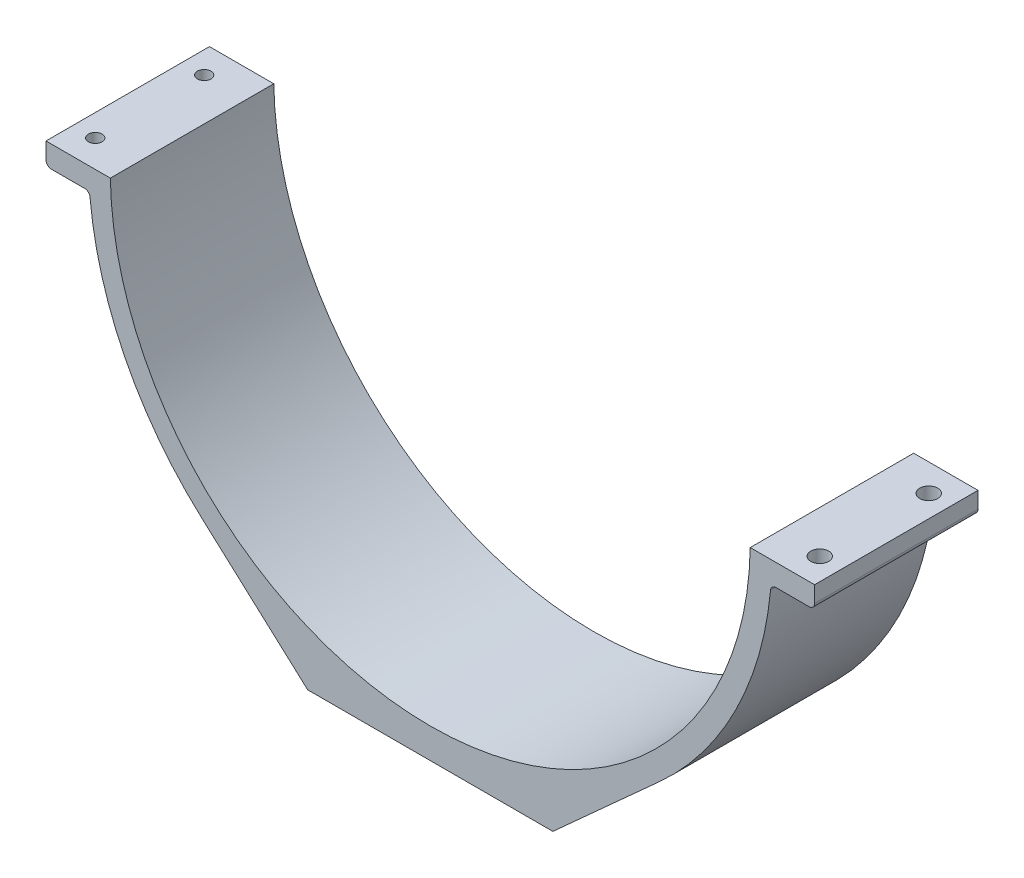
ISO-10303-21;
HEADER;
FILE_DESCRIPTION(('STEP AP214'),'2;1');
FILE_NAME('part.step','',(''),(''),'','','');
FILE_SCHEMA(('AUTOMOTIVE_DESIGN { 1 0 10303 214 1 1 1 1 }'));
ENDSEC;
DATA;
#1=APPLICATION_CONTEXT('core data for automotive mechanical design processes');
#2=APPLICATION_PROTOCOL_DEFINITION('international standard','automotive_design',2000,#1);
#3=PRODUCT_CONTEXT('',#1,'mechanical');
#4=PRODUCT('Part','Part','',(#3));
#5=PRODUCT_RELATED_PRODUCT_CATEGORY('part','',(#4));
#6=PRODUCT_DEFINITION_FORMATION('','',#4);
#7=PRODUCT_DEFINITION_CONTEXT('part definition',#1,'design');
#8=PRODUCT_DEFINITION('design','',#6,#7);
#9=PRODUCT_DEFINITION_SHAPE('','',#8);
#10=(LENGTH_UNIT() NAMED_UNIT(*) SI_UNIT(.MILLI.,.METRE.));
#11=(NAMED_UNIT(*) PLANE_ANGLE_UNIT() SI_UNIT($,.RADIAN.));
#12=(NAMED_UNIT(*) SI_UNIT($,.STERADIAN.) SOLID_ANGLE_UNIT());
#13=UNCERTAINTY_MEASURE_WITH_UNIT(LENGTH_MEASURE(1.E-05),#10,'distance_accuracy_value','');
#14=(GEOMETRIC_REPRESENTATION_CONTEXT(3) GLOBAL_UNCERTAINTY_ASSIGNED_CONTEXT((#13)) GLOBAL_UNIT_ASSIGNED_CONTEXT((#10,
#11,#12)) REPRESENTATION_CONTEXT('',''));
#15=CARTESIAN_POINT('',(0.,0.,0.));
#16=DIRECTION('',(0.,0.,1.));
#17=DIRECTION('',(1.,0.,0.));
#18=AXIS2_PLACEMENT_3D('',#15,#16,#17);
#19=CARTESIAN_POINT('',(-70.5404477118608,-1.,30.));
#20=DIRECTION('',(1.,0.,0.));
#21=DIRECTION('',(0.,1.,0.));
#22=AXIS2_PLACEMENT_3D('',#19,#20,#21);
#23=PLANE('',#22);
#24=DIRECTION('',(0.,-1.,0.));
#25=VECTOR('',#24,1.);
#26=CARTESIAN_POINT('',(-70.5404477118608,-1.,0.));
#27=LINE('',#26,#25);
#28=CARTESIAN_POINT('',(-70.5404477118608,-1.,0.));
#29=VERTEX_POINT('',#28);
#30=CARTESIAN_POINT('',(-70.5404477118608,-4.,0.));
#31=VERTEX_POINT('',#30);
#32=EDGE_CURVE('E200',#29,#31,#27,.T.);
#33=ORIENTED_EDGE('',*,*,#32,.T.);
#34=DIRECTION('',(0.,0.,-1.));
#35=VECTOR('',#34,1.);
#36=CARTESIAN_POINT('',(-70.5404477118608,-4.,30.));
#37=LINE('',#36,#35);
#38=CARTESIAN_POINT('',(-70.5404477118608,-4.,30.));
#39=VERTEX_POINT('',#38);
#40=EDGE_CURVE('E11',#39,#31,#37,.T.);
#41=ORIENTED_EDGE('',*,*,#40,.F.);
#42=DIRECTION('',(0.,-1.,0.));
#43=VECTOR('',#42,1.);
#44=CARTESIAN_POINT('',(-70.5404477118608,-1.,30.));
#45=LINE('',#44,#43);
#46=CARTESIAN_POINT('',(-70.5404477118608,-1.,30.));
#47=VERTEX_POINT('',#46);
#48=EDGE_CURVE('E246',#47,#39,#45,.T.);
#49=ORIENTED_EDGE('',*,*,#48,.F.);
#50=DIRECTION('',(0.,0.,-1.));
#51=VECTOR('',#50,1.);
#52=CARTESIAN_POINT('',(-70.5404477118608,-1.,30.));
#53=LINE('',#52,#51);
#54=EDGE_CURVE('E196',#47,#29,#53,.T.);
#55=ORIENTED_EDGE('',*,*,#54,.T.);
#56=EDGE_LOOP('',(#33,#41,#49,#55));
#57=FACE_BOUND('',#56,.T.);
#58=ADVANCED_FACE('F45',(#57),#23,.F.);
#59=CARTESIAN_POINT('',(-69.5404477118608,-4.,30.));
#60=DIRECTION('',(0.,0.,-1.));
#61=DIRECTION('',(-1.,0.,0.));
#62=AXIS2_PLACEMENT_3D('',#59,#60,#61);
#63=CYLINDRICAL_SURFACE('',#62,0.999999999999994);
#64=CARTESIAN_POINT('',(-69.5404477118608,-4.,0.));
#65=DIRECTION('',(0.,0.,1.));
#66=DIRECTION('',(1.,0.,0.));
#67=AXIS2_PLACEMENT_3D('',#64,#65,#66);
#68=CIRCLE('',#67,0.999999999999994);
#69=CARTESIAN_POINT('',(-69.5404477118608,-5.,0.));
#70=VERTEX_POINT('',#69);
#71=EDGE_CURVE('E204',#31,#70,#68,.T.);
#72=ORIENTED_EDGE('',*,*,#71,.T.);
#73=DIRECTION('',(0.,0.,-1.));
#74=VECTOR('',#73,1.);
#75=CARTESIAN_POINT('',(-69.5404477118608,-5.,30.));
#76=LINE('',#75,#74);
#77=CARTESIAN_POINT('',(-69.5404477118608,-5.,30.));
#78=VERTEX_POINT('',#77);
#79=EDGE_CURVE('E54',#78,#70,#76,.T.);
#80=ORIENTED_EDGE('',*,*,#79,.F.);
#81=CARTESIAN_POINT('',(-69.5404477118608,-4.,30.));
#82=DIRECTION('',(0.,0.,1.));
#83=DIRECTION('',(1.,0.,0.));
#84=AXIS2_PLACEMENT_3D('',#81,#82,#83);
#85=CIRCLE('',#84,0.999999999999994);
#86=EDGE_CURVE('E130',#39,#78,#85,.T.);
#87=ORIENTED_EDGE('',*,*,#86,.F.);
#88=ORIENTED_EDGE('',*,*,#40,.T.);
#89=EDGE_LOOP('',(#72,#80,#87,#88));
#90=FACE_BOUND('',#89,.T.);
#91=ADVANCED_FACE('F440',(#90),#63,.T.);
#92=CARTESIAN_POINT('',(-69.5404477118608,-5.,30.));
#93=DIRECTION('',(0.,1.,0.));
#94=DIRECTION('',(-1.,0.,0.));
#95=AXIS2_PLACEMENT_3D('',#92,#93,#94);
#96=PLANE('',#95);
#97=CARTESIAN_POINT('',(-66.4987110559215,-4.99999999999999,5.));
#98=DIRECTION('',(0.,-1.,0.));
#99=DIRECTION('',(0.,0.,-1.));
#100=AXIS2_PLACEMENT_3D('',#97,#98,#99);
#101=CIRCLE('',#100,1.24999999999999);
#102=CARTESIAN_POINT('',(-66.4987110559215,-4.99999999999999,3.75000000000001));
#103=VERTEX_POINT('',#102);
#104=EDGE_CURVE('E419',#103,#103,#101,.T.);
#105=ORIENTED_EDGE('',*,*,#104,.F.);
#106=EDGE_LOOP('',(#105));
#107=FACE_BOUND('',#106,.T.);
#108=CARTESIAN_POINT('',(-66.4987110559215,-4.99999999999999,25.));
#109=DIRECTION('',(0.,-1.,0.));
#110=DIRECTION('',(0.,0.,-1.));
#111=AXIS2_PLACEMENT_3D('',#108,#109,#110);
#112=CIRCLE('',#111,1.24999999999999);
#113=CARTESIAN_POINT('',(-66.4987110559215,-4.99999999999999,23.75));
#114=VERTEX_POINT('',#113);
#115=EDGE_CURVE('E427',#114,#114,#112,.T.);
#116=ORIENTED_EDGE('',*,*,#115,.F.);
#117=EDGE_LOOP('',(#116));
#118=FACE_BOUND('',#117,.T.);
#119=DIRECTION('',(1.,0.,0.));
#120=VECTOR('',#119,1.);
#121=CARTESIAN_POINT('',(-69.5404477118608,-5.,0.));
#122=LINE('',#121,#120);
#123=CARTESIAN_POINT('',(-63.4569743999822,-4.99999999999999,0.));
#124=VERTEX_POINT('',#123);
#125=EDGE_CURVE('E208',#70,#124,#122,.T.);
#126=ORIENTED_EDGE('',*,*,#125,.T.);
#127=DIRECTION('',(0.,0.,-1.));
#128=VECTOR('',#127,1.);
#129=CARTESIAN_POINT('',(-63.4569743999822,-4.99999999999999,30.));
#130=LINE('',#129,#128);
#131=CARTESIAN_POINT('',(-63.4569743999822,-4.99999999999999,30.));
#132=VERTEX_POINT('',#131);
#133=EDGE_CURVE('E288',#132,#124,#130,.T.);
#134=ORIENTED_EDGE('',*,*,#133,.F.);
#135=DIRECTION('',(1.,0.,0.));
#136=VECTOR('',#135,1.);
#137=CARTESIAN_POINT('',(-69.5404477118608,-5.,30.));
#138=LINE('',#137,#136);
#139=EDGE_CURVE('E299',#78,#132,#138,.T.);
#140=ORIENTED_EDGE('',*,*,#139,.F.);
#141=ORIENTED_EDGE('',*,*,#79,.T.);
#142=EDGE_LOOP('',(#126,#134,#140,#141));
#143=FACE_BOUND('',#142,.T.);
#144=ADVANCED_FACE('F297',(#107,#118,#143),#96,.F.);
#145=CARTESIAN_POINT('',(-63.4569743999822,-6.,30.));
#146=DIRECTION('',(0.,0.,-1.));
#147=DIRECTION('',(-1.,0.,0.));
#148=AXIS2_PLACEMENT_3D('',#145,#146,#147);
#149=CYLINDRICAL_SURFACE('',#148,1.00000000000001);
#150=CARTESIAN_POINT('',(-63.4569743999822,-6.,0.));
#151=DIRECTION('',(0.,0.,-1.));
#152=DIRECTION('',(1.,0.,0.));
#153=AXIS2_PLACEMENT_3D('',#150,#151,#152);
#154=CIRCLE('',#153,1.00000000000001);
#155=CARTESIAN_POINT('',(-62.4614147137572,-5.90586758707246,0.));
#156=VERTEX_POINT('',#155);
#157=EDGE_CURVE('E211',#124,#156,#154,.T.);
#158=ORIENTED_EDGE('',*,*,#157,.T.);
#159=DIRECTION('',(0.,0.,-1.));
#160=VECTOR('',#159,1.);
#161=CARTESIAN_POINT('',(-62.4614147137572,-5.90586758707246,30.));
#162=LINE('',#161,#160);
#163=CARTESIAN_POINT('',(-62.4614147137572,-5.90586758707246,30.));
#164=VERTEX_POINT('',#163);
#165=EDGE_CURVE('E284',#164,#156,#162,.T.);
#166=ORIENTED_EDGE('',*,*,#165,.F.);
#167=CARTESIAN_POINT('',(-63.4569743999822,-6.,30.));
#168=DIRECTION('',(0.,0.,-1.));
#169=DIRECTION('',(1.,0.,0.));
#170=AXIS2_PLACEMENT_3D('',#167,#168,#169);
#171=CIRCLE('',#170,1.00000000000001);
#172=EDGE_CURVE('E318',#132,#164,#171,.T.);
#173=ORIENTED_EDGE('',*,*,#172,.F.);
#174=ORIENTED_EDGE('',*,*,#133,.T.);
#175=EDGE_LOOP('',(#158,#166,#173,#174));
#176=FACE_BOUND('',#175,.T.);
#177=ADVANCED_FACE('F308',(#176),#149,.F.);
#178=CARTESIAN_POINT('',(0.,0.,30.));
#179=DIRECTION('',(0.,0.,-1.));
#180=DIRECTION('',(-1.,0.,0.));
#181=AXIS2_PLACEMENT_3D('',#178,#179,#180);
#182=CYLINDRICAL_SURFACE('',#181,62.74);
#183=CARTESIAN_POINT('',(0.,0.,0.));
#184=DIRECTION('',(0.,0.,1.));
#185=DIRECTION('',(1.,0.,0.));
#186=AXIS2_PLACEMENT_3D('',#183,#184,#185);
#187=CIRCLE('',#186,62.74);
#188=CARTESIAN_POINT('',(-42.0786666547349,-46.5370112121491,0.));
#189=VERTEX_POINT('',#188);
#190=EDGE_CURVE('E214',#156,#189,#187,.T.);
#191=ORIENTED_EDGE('',*,*,#190,.T.);
#192=DIRECTION('',(0.,0.,-1.));
#193=VECTOR('',#192,1.);
#194=CARTESIAN_POINT('',(-42.0786666547349,-46.5370112121491,30.));
#195=LINE('',#194,#193);
#196=CARTESIAN_POINT('',(-42.0786666547349,-46.5370112121491,30.));
#197=VERTEX_POINT('',#196);
#198=EDGE_CURVE('E280',#197,#189,#195,.T.);
#199=ORIENTED_EDGE('',*,*,#198,.F.);
#200=CARTESIAN_POINT('',(0.,0.,30.));
#201=DIRECTION('',(0.,0.,1.));
#202=DIRECTION('',(1.,0.,0.));
#203=AXIS2_PLACEMENT_3D('',#200,#201,#202);
#204=CIRCLE('',#203,62.74);
#205=EDGE_CURVE('E314',#164,#197,#204,.T.);
#206=ORIENTED_EDGE('',*,*,#205,.F.);
#207=ORIENTED_EDGE('',*,*,#165,.T.);
#208=EDGE_LOOP('',(#191,#199,#206,#207));
#209=FACE_BOUND('',#208,.T.);
#210=ADVANCED_FACE('F312',(#209),#182,.T.);
#211=CARTESIAN_POINT('',(-22.5,-64.24,30.));
#212=DIRECTION('',(0.670683242823318,0.741743882884112,0.));
#213=DIRECTION('',(-0.741743882884112,0.670683242823318,0.));
#214=AXIS2_PLACEMENT_3D('',#211,#212,#213);
#215=PLANE('',#214);
#216=DIRECTION('',(0.741743882884112,-0.670683242823318,0.));
#217=VECTOR('',#216,1.);
#218=CARTESIAN_POINT('',(-22.5,-64.24,0.));
#219=LINE('',#218,#217);
#220=CARTESIAN_POINT('',(-22.5,-64.24,0.));
#221=VERTEX_POINT('',#220);
#222=EDGE_CURVE('E217',#189,#221,#219,.T.);
#223=ORIENTED_EDGE('',*,*,#222,.T.);
#224=DIRECTION('',(0.,0.,-1.));
#225=VECTOR('',#224,1.);
#226=CARTESIAN_POINT('',(-22.5,-64.24,30.));
#227=LINE('',#226,#225);
#228=CARTESIAN_POINT('',(-22.5,-64.24,30.));
#229=VERTEX_POINT('',#228);
#230=EDGE_CURVE('E276',#229,#221,#227,.T.);
#231=ORIENTED_EDGE('',*,*,#230,.F.);
#232=DIRECTION('',(0.741743882884112,-0.670683242823318,0.));
#233=VECTOR('',#232,1.);
#234=CARTESIAN_POINT('',(-22.5,-64.24,30.));
#235=LINE('',#234,#233);
#236=EDGE_CURVE('E317',#197,#229,#235,.T.);
#237=ORIENTED_EDGE('',*,*,#236,.F.);
#238=ORIENTED_EDGE('',*,*,#198,.T.);
#239=EDGE_LOOP('',(#223,#231,#237,#238));
#240=FACE_BOUND('',#239,.T.);
#241=ADVANCED_FACE('F453',(#240),#215,.F.);
#242=CARTESIAN_POINT('',(-22.5,-64.24,30.));
#243=DIRECTION('',(0.,1.,0.));
#244=DIRECTION('',(0.,0.,1.));
#245=AXIS2_PLACEMENT_3D('',#242,#243,#244);
#246=PLANE('',#245);
#247=CARTESIAN_POINT('',(-20.,-64.24,5.));
#248=DIRECTION('',(0.,-1.,0.));
#249=DIRECTION('',(0.,0.,-1.));
#250=AXIS2_PLACEMENT_3D('',#247,#248,#249);
#251=CIRCLE('',#250,1.65);
#252=CARTESIAN_POINT('',(-20.,-64.24,3.35));
#253=VERTEX_POINT('',#252);
#254=EDGE_CURVE('E365',#253,#253,#251,.T.);
#255=ORIENTED_EDGE('',*,*,#254,.F.);
#256=EDGE_LOOP('',(#255));
#257=FACE_BOUND('',#256,.T.);
#258=CARTESIAN_POINT('',(20.,-64.24,5.));
#259=DIRECTION('',(0.,-1.,0.));
#260=DIRECTION('',(0.,0.,-1.));
#261=AXIS2_PLACEMENT_3D('',#258,#259,#260);
#262=CIRCLE('',#261,1.65);
#263=CARTESIAN_POINT('',(20.,-64.24,3.35));
#264=VERTEX_POINT('',#263);
#265=EDGE_CURVE('E364',#264,#264,#262,.T.);
#266=ORIENTED_EDGE('',*,*,#265,.F.);
#267=EDGE_LOOP('',(#266));
#268=FACE_BOUND('',#267,.T.);
#269=CARTESIAN_POINT('',(-20.0000000000051,-64.24,25.));
#270=DIRECTION('',(0.,-1.,0.));
#271=DIRECTION('',(0.,0.,-1.));
#272=AXIS2_PLACEMENT_3D('',#269,#270,#271);
#273=CIRCLE('',#272,1.65);
#274=CARTESIAN_POINT('',(-20.0000000000051,-64.24,23.35));
#275=VERTEX_POINT('',#274);
#276=EDGE_CURVE('E371',#275,#275,#273,.T.);
#277=ORIENTED_EDGE('',*,*,#276,.F.);
#278=EDGE_LOOP('',(#277));
#279=FACE_BOUND('',#278,.T.);
#280=CARTESIAN_POINT('',(20.0000000000051,-64.24,25.));
#281=DIRECTION('',(0.,-1.,0.));
#282=DIRECTION('',(0.,0.,-1.));
#283=AXIS2_PLACEMENT_3D('',#280,#281,#282);
#284=CIRCLE('',#283,1.65);
#285=CARTESIAN_POINT('',(20.0000000000051,-64.24,23.35));
#286=VERTEX_POINT('',#285);
#287=EDGE_CURVE('E370',#286,#286,#284,.T.);
#288=ORIENTED_EDGE('',*,*,#287,.F.);
#289=EDGE_LOOP('',(#288));
#290=FACE_BOUND('',#289,.T.);
#291=DIRECTION('',(1.,0.,0.));
#292=VECTOR('',#291,1.);
#293=CARTESIAN_POINT('',(-22.5,-64.24,0.));
#294=LINE('',#293,#292);
#295=CARTESIAN_POINT('',(22.5,-64.24,0.));
#296=VERTEX_POINT('',#295);
#297=EDGE_CURVE('E220',#221,#296,#294,.T.);
#298=ORIENTED_EDGE('',*,*,#297,.T.);
#299=DIRECTION('',(0.,0.,-1.));
#300=VECTOR('',#299,1.);
#301=CARTESIAN_POINT('',(22.5,-64.24,30.));
#302=LINE('',#301,#300);
#303=CARTESIAN_POINT('',(22.5,-64.24,30.));
#304=VERTEX_POINT('',#303);
#305=EDGE_CURVE('E272',#304,#296,#302,.T.);
#306=ORIENTED_EDGE('',*,*,#305,.F.);
#307=DIRECTION('',(1.,0.,0.));
#308=VECTOR('',#307,1.);
#309=CARTESIAN_POINT('',(-22.5,-64.24,30.));
#310=LINE('',#309,#308);
#311=EDGE_CURVE('E323',#229,#304,#310,.T.);
#312=ORIENTED_EDGE('',*,*,#311,.F.);
#313=ORIENTED_EDGE('',*,*,#230,.T.);
#314=EDGE_LOOP('',(#298,#306,#312,#313));
#315=FACE_BOUND('',#314,.T.);
#316=ADVANCED_FACE('F456',(#257,#268,#279,#290,#315),#246,.F.);
#317=CARTESIAN_POINT('',(22.5,-64.24,30.));
#318=DIRECTION('',(-0.670683242823318,0.741743882884111,0.));
#319=DIRECTION('',(-0.741743882884111,-0.670683242823318,0.));
#320=AXIS2_PLACEMENT_3D('',#317,#318,#319);
#321=PLANE('',#320);
#322=DIRECTION('',(0.741743882884111,0.670683242823318,0.));
#323=VECTOR('',#322,1.);
#324=CARTESIAN_POINT('',(22.5,-64.24,0.));
#325=LINE('',#324,#323);
#326=CARTESIAN_POINT('',(42.078666654735,-46.5370112121491,0.));
#327=VERTEX_POINT('',#326);
#328=EDGE_CURVE('E223',#296,#327,#325,.T.);
#329=ORIENTED_EDGE('',*,*,#328,.T.);
#330=DIRECTION('',(0.,0.,-1.));
#331=VECTOR('',#330,1.);
#332=CARTESIAN_POINT('',(42.078666654735,-46.5370112121491,30.));
#333=LINE('',#332,#331);
#334=CARTESIAN_POINT('',(42.078666654735,-46.5370112121491,30.));
#335=VERTEX_POINT('',#334);
#336=EDGE_CURVE('E268',#335,#327,#333,.T.);
#337=ORIENTED_EDGE('',*,*,#336,.F.);
#338=DIRECTION('',(0.741743882884111,0.670683242823318,0.));
#339=VECTOR('',#338,1.);
#340=CARTESIAN_POINT('',(22.5,-64.24,30.));
#341=LINE('',#340,#339);
#342=EDGE_CURVE('E331',#304,#335,#341,.T.);
#343=ORIENTED_EDGE('',*,*,#342,.F.);
#344=ORIENTED_EDGE('',*,*,#305,.T.);
#345=EDGE_LOOP('',(#329,#337,#343,#344));
#346=FACE_BOUND('',#345,.T.);
#347=ADVANCED_FACE('F460',(#346),#321,.F.);
#348=CARTESIAN_POINT('',(0.,0.,30.));
#349=DIRECTION('',(0.,0.,-1.));
#350=DIRECTION('',(-1.,0.,0.));
#351=AXIS2_PLACEMENT_3D('',#348,#349,#350);
#352=CYLINDRICAL_SURFACE('',#351,62.74);
#353=CARTESIAN_POINT('',(0.,0.,0.));
#354=DIRECTION('',(0.,0.,1.));
#355=DIRECTION('',(-1.,0.,0.));
#356=AXIS2_PLACEMENT_3D('',#353,#354,#355);
#357=CIRCLE('',#356,62.74);
#358=CARTESIAN_POINT('',(62.4614147137572,-5.90586758707248,0.));
#359=VERTEX_POINT('',#358);
#360=EDGE_CURVE('E226',#327,#359,#357,.T.);
#361=ORIENTED_EDGE('',*,*,#360,.T.);
#362=DIRECTION('',(0.,0.,-1.));
#363=VECTOR('',#362,1.);
#364=CARTESIAN_POINT('',(62.4614147137572,-5.90586758707248,30.));
#365=LINE('',#364,#363);
#366=CARTESIAN_POINT('',(62.4614147137572,-5.90586758707248,30.));
#367=VERTEX_POINT('',#366);
#368=EDGE_CURVE('E264',#367,#359,#365,.T.);
#369=ORIENTED_EDGE('',*,*,#368,.F.);
#370=CARTESIAN_POINT('',(0.,0.,30.));
#371=DIRECTION('',(0.,0.,1.));
#372=DIRECTION('',(-1.,0.,0.));
#373=AXIS2_PLACEMENT_3D('',#370,#371,#372);
#374=CIRCLE('',#373,62.74);
#375=EDGE_CURVE('E334',#335,#367,#374,.T.);
#376=ORIENTED_EDGE('',*,*,#375,.F.);
#377=ORIENTED_EDGE('',*,*,#336,.T.);
#378=EDGE_LOOP('',(#361,#369,#376,#377));
#379=FACE_BOUND('',#378,.T.);
#380=ADVANCED_FACE('F464',(#379),#352,.T.);
#381=CARTESIAN_POINT('',(63.4569743999822,-6.,30.));
#382=DIRECTION('',(0.,0.,-1.));
#383=DIRECTION('',(-1.,0.,0.));
#384=AXIS2_PLACEMENT_3D('',#381,#382,#383);
#385=CYLINDRICAL_SURFACE('',#384,1.00000000000001);
#386=CARTESIAN_POINT('',(63.4569743999822,-6.,0.));
#387=DIRECTION('',(0.,0.,-1.));
#388=DIRECTION('',(-1.,0.,0.));
#389=AXIS2_PLACEMENT_3D('',#386,#387,#388);
#390=CIRCLE('',#389,1.00000000000001);
#391=CARTESIAN_POINT('',(63.4569743999822,-5.,0.));
#392=VERTEX_POINT('',#391);
#393=EDGE_CURVE('E229',#359,#392,#390,.T.);
#394=ORIENTED_EDGE('',*,*,#393,.T.);
#395=DIRECTION('',(0.,0.,-1.));
#396=VECTOR('',#395,1.);
#397=CARTESIAN_POINT('',(63.4569743999822,-5.,30.));
#398=LINE('',#397,#396);
#399=CARTESIAN_POINT('',(63.4569743999822,-5.,30.));
#400=VERTEX_POINT('',#399);
#401=EDGE_CURVE('E260',#400,#392,#398,.T.);
#402=ORIENTED_EDGE('',*,*,#401,.F.);
#403=CARTESIAN_POINT('',(63.4569743999822,-6.,30.));
#404=DIRECTION('',(0.,0.,-1.));
#405=DIRECTION('',(-1.,0.,0.));
#406=AXIS2_PLACEMENT_3D('',#403,#404,#405);
#407=CIRCLE('',#406,1.00000000000001);
#408=EDGE_CURVE('E337',#367,#400,#407,.T.);
#409=ORIENTED_EDGE('',*,*,#408,.F.);
#410=ORIENTED_EDGE('',*,*,#368,.T.);
#411=EDGE_LOOP('',(#394,#402,#409,#410));
#412=FACE_BOUND('',#411,.T.);
#413=ADVANCED_FACE('F468',(#412),#385,.F.);
#414=CARTESIAN_POINT('',(69.5404477118608,-4.99999999999998,30.));
#415=DIRECTION('',(0.,1.,0.));
#416=DIRECTION('',(-1.,0.,0.));
#417=AXIS2_PLACEMENT_3D('',#414,#415,#416);
#418=PLANE('',#417);
#419=CARTESIAN_POINT('',(66.4987110559139,-5.00000000000016,5.00000000001225));
#420=DIRECTION('',(0.,-1.,0.));
#421=DIRECTION('',(0.,0.,-1.));
#422=AXIS2_PLACEMENT_3D('',#419,#420,#421);
#423=CIRCLE('',#422,1.65);
#424=CARTESIAN_POINT('',(66.4987110559139,-5.00000000000016,3.35000000001225));
#425=VERTEX_POINT('',#424);
#426=EDGE_CURVE('E389',#425,#425,#423,.T.);
#427=ORIENTED_EDGE('',*,*,#426,.F.);
#428=EDGE_LOOP('',(#427));
#429=FACE_BOUND('',#428,.T.);
#430=CARTESIAN_POINT('',(66.4987110559139,-5.00000000000016,25.0000000000122));
#431=DIRECTION('',(0.,-1.,0.));
#432=DIRECTION('',(0.,0.,-1.));
#433=AXIS2_PLACEMENT_3D('',#430,#431,#432);
#434=CIRCLE('',#433,1.65);
#435=CARTESIAN_POINT('',(66.4987110559139,-5.00000000000016,23.3500000000122));
#436=VERTEX_POINT('',#435);
#437=EDGE_CURVE('E381',#436,#436,#434,.T.);
#438=ORIENTED_EDGE('',*,*,#437,.F.);
#439=EDGE_LOOP('',(#438));
#440=FACE_BOUND('',#439,.T.);
#441=DIRECTION('',(1.,0.,0.));
#442=VECTOR('',#441,1.);
#443=CARTESIAN_POINT('',(69.5404477118608,-4.99999999999998,0.));
#444=LINE('',#443,#442);
#445=CARTESIAN_POINT('',(69.5404477118608,-4.99999999999998,0.));
#446=VERTEX_POINT('',#445);
#447=EDGE_CURVE('E232',#392,#446,#444,.T.);
#448=ORIENTED_EDGE('',*,*,#447,.T.);
#449=DIRECTION('',(0.,0.,-1.));
#450=VECTOR('',#449,1.);
#451=CARTESIAN_POINT('',(69.5404477118608,-4.99999999999998,30.));
#452=LINE('',#451,#450);
#453=CARTESIAN_POINT('',(69.5404477118608,-4.99999999999998,30.));
#454=VERTEX_POINT('',#453);
#455=EDGE_CURVE('E256',#454,#446,#452,.T.);
#456=ORIENTED_EDGE('',*,*,#455,.F.);
#457=DIRECTION('',(1.,0.,0.));
#458=VECTOR('',#457,1.);
#459=CARTESIAN_POINT('',(69.5404477118608,-4.99999999999998,30.));
#460=LINE('',#459,#458);
#461=EDGE_CURVE('E340',#400,#454,#460,.T.);
#462=ORIENTED_EDGE('',*,*,#461,.F.);
#463=ORIENTED_EDGE('',*,*,#401,.T.);
#464=EDGE_LOOP('',(#448,#456,#462,#463));
#465=FACE_BOUND('',#464,.T.);
#466=ADVANCED_FACE('F472',(#429,#440,#465),#418,.F.);
#467=CARTESIAN_POINT('',(69.5404477118608,-3.99999999999998,30.));
#468=DIRECTION('',(0.,0.,-1.));
#469=DIRECTION('',(-1.,0.,0.));
#470=AXIS2_PLACEMENT_3D('',#467,#468,#469);
#471=CYLINDRICAL_SURFACE('',#470,0.999999999999994);
#472=CARTESIAN_POINT('',(69.5404477118608,-3.99999999999998,0.));
#473=DIRECTION('',(0.,0.,1.));
#474=DIRECTION('',(-1.,0.,0.));
#475=AXIS2_PLACEMENT_3D('',#472,#473,#474);
#476=CIRCLE('',#475,0.999999999999994);
#477=CARTESIAN_POINT('',(70.5404477118608,-3.99999999999998,0.));
#478=VERTEX_POINT('',#477);
#479=EDGE_CURVE('E235',#446,#478,#476,.T.);
#480=ORIENTED_EDGE('',*,*,#479,.T.);
#481=DIRECTION('',(0.,0.,-1.));
#482=VECTOR('',#481,1.);
#483=CARTESIAN_POINT('',(70.5404477118608,-3.99999999999998,30.));
#484=LINE('',#483,#482);
#485=CARTESIAN_POINT('',(70.5404477118608,-3.99999999999998,30.));
#486=VERTEX_POINT('',#485);
#487=EDGE_CURVE('E252',#486,#478,#484,.T.);
#488=ORIENTED_EDGE('',*,*,#487,.F.);
#489=CARTESIAN_POINT('',(69.5404477118608,-3.99999999999998,30.));
#490=DIRECTION('',(0.,0.,1.));
#491=DIRECTION('',(-1.,0.,0.));
#492=AXIS2_PLACEMENT_3D('',#489,#490,#491);
#493=CIRCLE('',#492,0.999999999999994);
#494=EDGE_CURVE('E343',#454,#486,#493,.T.);
#495=ORIENTED_EDGE('',*,*,#494,.F.);
#496=ORIENTED_EDGE('',*,*,#455,.T.);
#497=EDGE_LOOP('',(#480,#488,#495,#496));
#498=FACE_BOUND('',#497,.T.);
#499=ADVANCED_FACE('F476',(#498),#471,.T.);
#500=CARTESIAN_POINT('',(70.5404477118608,-0.999999999999983,30.));
#501=DIRECTION('',(-1.,0.,0.));
#502=DIRECTION('',(0.,-1.,0.));
#503=AXIS2_PLACEMENT_3D('',#500,#501,#502);
#504=PLANE('',#503);
#505=DIRECTION('',(0.,1.,0.));
#506=VECTOR('',#505,1.);
#507=CARTESIAN_POINT('',(70.5404477118608,-0.999999999999983,0.));
#508=LINE('',#507,#506);
#509=CARTESIAN_POINT('',(70.5404477118608,-0.999999999999983,0.));
#510=VERTEX_POINT('',#509);
#511=EDGE_CURVE('E238',#478,#510,#508,.T.);
#512=ORIENTED_EDGE('',*,*,#511,.T.);
#513=DIRECTION('',(0.,0.,-1.));
#514=VECTOR('',#513,1.);
#515=CARTESIAN_POINT('',(70.5404477118608,-0.999999999999983,30.));
#516=LINE('',#515,#514);
#517=CARTESIAN_POINT('',(70.5404477118608,-0.999999999999983,30.));
#518=VERTEX_POINT('',#517);
#519=EDGE_CURVE('E186',#518,#510,#516,.T.);
#520=ORIENTED_EDGE('',*,*,#519,.F.);
#521=DIRECTION('',(0.,1.,0.));
#522=VECTOR('',#521,1.);
#523=CARTESIAN_POINT('',(70.5404477118608,-0.999999999999983,30.));
#524=LINE('',#523,#522);
#525=EDGE_CURVE('E175',#486,#518,#524,.T.);
#526=ORIENTED_EDGE('',*,*,#525,.F.);
#527=ORIENTED_EDGE('',*,*,#487,.T.);
#528=EDGE_LOOP('',(#512,#520,#526,#527));
#529=FACE_BOUND('',#528,.T.);
#530=ADVANCED_FACE('F480',(#529),#504,.F.);
#531=CARTESIAN_POINT('',(70.5404477118608,-0.999999999999983,30.));
#532=DIRECTION('',(0.,-1.,0.));
#533=DIRECTION('',(1.,0.,0.));
#534=AXIS2_PLACEMENT_3D('',#531,#532,#533);
#535=PLANE('',#534);
#536=CARTESIAN_POINT('',(66.4987110559139,-0.999999999999983,5.00000000001225));
#537=DIRECTION('',(0.,-1.,0.));
#538=DIRECTION('',(0.,0.,-1.));
#539=AXIS2_PLACEMENT_3D('',#536,#537,#538);
#540=CIRCLE('',#539,1.65);
#541=CARTESIAN_POINT('',(66.4987110559139,-0.999999999999983,3.35000000001225));
#542=VERTEX_POINT('',#541);
#543=EDGE_CURVE('E384',#542,#542,#540,.T.);
#544=ORIENTED_EDGE('',*,*,#543,.T.);
#545=EDGE_LOOP('',(#544));
#546=FACE_BOUND('',#545,.T.);
#547=CARTESIAN_POINT('',(66.4987110559139,-0.999999999999983,25.0000000000122));
#548=DIRECTION('',(0.,-1.,0.));
#549=DIRECTION('',(0.,0.,-1.));
#550=AXIS2_PLACEMENT_3D('',#547,#548,#549);
#551=CIRCLE('',#550,1.65);
#552=CARTESIAN_POINT('',(66.4987110559139,-0.999999999999983,23.3500000000122));
#553=VERTEX_POINT('',#552);
#554=EDGE_CURVE('E377',#553,#553,#551,.T.);
#555=ORIENTED_EDGE('',*,*,#554,.T.);
#556=EDGE_LOOP('',(#555));
#557=FACE_BOUND('',#556,.T.);
#558=DIRECTION('',(-1.,0.,0.));
#559=VECTOR('',#558,1.);
#560=CARTESIAN_POINT('',(70.5404477118608,-0.999999999999983,0.));
#561=LINE('',#560,#559);
#562=CARTESIAN_POINT('',(58.7314872959982,-0.999999999999991,0.));
#563=VERTEX_POINT('',#562);
#564=EDGE_CURVE('E184',#510,#563,#561,.T.);
#565=ORIENTED_EDGE('',*,*,#564,.T.);
#566=DIRECTION('',(0.,0.,-1.));
#567=VECTOR('',#566,1.);
#568=CARTESIAN_POINT('',(58.7314872959982,-0.999999999999991,30.));
#569=LINE('',#568,#567);
#570=CARTESIAN_POINT('',(58.7314872959982,-0.999999999999991,30.));
#571=VERTEX_POINT('',#570);
#572=EDGE_CURVE('E181',#571,#563,#569,.T.);
#573=ORIENTED_EDGE('',*,*,#572,.F.);
#574=DIRECTION('',(-1.,0.,0.));
#575=VECTOR('',#574,1.);
#576=CARTESIAN_POINT('',(70.5404477118608,-0.999999999999983,30.));
#577=LINE('',#576,#575);
#578=EDGE_CURVE('E169',#518,#571,#577,.T.);
#579=ORIENTED_EDGE('',*,*,#578,.F.);
#580=ORIENTED_EDGE('',*,*,#519,.T.);
#581=EDGE_LOOP('',(#565,#573,#579,#580));
#582=FACE_BOUND('',#581,.T.);
#583=ADVANCED_FACE('F182',(#546,#557,#582),#535,.F.);
#584=CARTESIAN_POINT('',(0.,0.,30.));
#585=DIRECTION('',(0.,0.,-1.));
#586=DIRECTION('',(-1.,0.,0.));
#587=AXIS2_PLACEMENT_3D('',#584,#585,#586);
#588=CYLINDRICAL_SURFACE('',#587,58.74);
#589=CARTESIAN_POINT('',(0.,0.,0.));
#590=DIRECTION('',(0.,0.,-1.));
#591=DIRECTION('',(1.,0.,0.));
#592=AXIS2_PLACEMENT_3D('',#589,#590,#591);
#593=CIRCLE('',#592,58.74);
#594=CARTESIAN_POINT('',(-58.7314872959982,-1.,0.));
#595=VERTEX_POINT('',#594);
#596=EDGE_CURVE('E116',#563,#595,#593,.T.);
#597=ORIENTED_EDGE('',*,*,#596,.T.);
#598=DIRECTION('',(0.,0.,-1.));
#599=VECTOR('',#598,1.);
#600=CARTESIAN_POINT('',(-58.7314872959982,-1.,30.));
#601=LINE('',#600,#599);
#602=CARTESIAN_POINT('',(-58.7314872959982,-1.,30.));
#603=VERTEX_POINT('',#602);
#604=EDGE_CURVE('E187',#603,#595,#601,.T.);
#605=ORIENTED_EDGE('',*,*,#604,.F.);
#606=CARTESIAN_POINT('',(0.,0.,30.));
#607=DIRECTION('',(0.,0.,-1.));
#608=DIRECTION('',(1.,0.,0.));
#609=AXIS2_PLACEMENT_3D('',#606,#607,#608);
#610=CIRCLE('',#609,58.74);
#611=EDGE_CURVE('E173',#571,#603,#610,.T.);
#612=ORIENTED_EDGE('',*,*,#611,.F.);
#613=ORIENTED_EDGE('',*,*,#572,.T.);
#614=EDGE_LOOP('',(#597,#605,#612,#613));
#615=FACE_BOUND('',#614,.T.);
#616=ADVANCED_FACE('F189',(#615),#588,.F.);
#617=CARTESIAN_POINT('',(-70.5404477118608,-1.,30.));
#618=DIRECTION('',(0.,-1.,0.));
#619=DIRECTION('',(0.,0.,-1.));
#620=AXIS2_PLACEMENT_3D('',#617,#618,#619);
#621=PLANE('',#620);
#622=CARTESIAN_POINT('',(-66.4987110559215,-0.99999999999999,5.));
#623=DIRECTION('',(0.,-1.,0.));
#624=DIRECTION('',(0.,0.,-1.));
#625=AXIS2_PLACEMENT_3D('',#622,#623,#624);
#626=CIRCLE('',#625,1.25);
#627=CARTESIAN_POINT('',(-66.4987110559215,-0.99999999999999,3.75));
#628=VERTEX_POINT('',#627);
#629=EDGE_CURVE('E423',#628,#628,#626,.T.);
#630=ORIENTED_EDGE('',*,*,#629,.T.);
#631=EDGE_LOOP('',(#630));
#632=FACE_BOUND('',#631,.T.);
#633=CARTESIAN_POINT('',(-66.4987110559215,-0.99999999999999,25.));
#634=DIRECTION('',(0.,-1.,0.));
#635=DIRECTION('',(0.,0.,-1.));
#636=AXIS2_PLACEMENT_3D('',#633,#634,#635);
#637=CIRCLE('',#636,1.25);
#638=CARTESIAN_POINT('',(-66.4987110559215,-0.99999999999999,23.75));
#639=VERTEX_POINT('',#638);
#640=EDGE_CURVE('E205',#639,#639,#637,.T.);
#641=ORIENTED_EDGE('',*,*,#640,.T.);
#642=EDGE_LOOP('',(#641));
#643=FACE_BOUND('',#642,.T.);
#644=DIRECTION('',(-1.,0.,0.));
#645=VECTOR('',#644,1.);
#646=CARTESIAN_POINT('',(-70.5404477118608,-1.,0.));
#647=LINE('',#646,#645);
#648=EDGE_CURVE('E122',#595,#29,#647,.T.);
#649=ORIENTED_EDGE('',*,*,#648,.T.);
#650=ORIENTED_EDGE('',*,*,#54,.F.);
#651=DIRECTION('',(-1.,0.,0.));
#652=VECTOR('',#651,1.);
#653=CARTESIAN_POINT('',(-70.5404477118608,-1.,30.));
#654=LINE('',#653,#652);
#655=EDGE_CURVE('E62',#603,#47,#654,.T.);
#656=ORIENTED_EDGE('',*,*,#655,.F.);
#657=ORIENTED_EDGE('',*,*,#604,.T.);
#658=EDGE_LOOP('',(#649,#650,#656,#657));
#659=FACE_BOUND('',#658,.T.);
#660=ADVANCED_FACE('F490',(#632,#643,#659),#621,.F.);
#661=CARTESIAN_POINT('',(-69.5404477118608,-4.,30.));
#662=DIRECTION('',(0.,0.,1.));
#663=DIRECTION('',(1.,0.,0.));
#664=AXIS2_PLACEMENT_3D('',#661,#662,#663);
#665=PLANE('',#664);
#666=ORIENTED_EDGE('',*,*,#48,.T.);
#667=ORIENTED_EDGE('',*,*,#86,.T.);
#668=ORIENTED_EDGE('',*,*,#139,.T.);
#669=ORIENTED_EDGE('',*,*,#172,.T.);
#670=ORIENTED_EDGE('',*,*,#205,.T.);
#671=ORIENTED_EDGE('',*,*,#236,.T.);
#672=ORIENTED_EDGE('',*,*,#311,.T.);
#673=ORIENTED_EDGE('',*,*,#342,.T.);
#674=ORIENTED_EDGE('',*,*,#375,.T.);
#675=ORIENTED_EDGE('',*,*,#408,.T.);
#676=ORIENTED_EDGE('',*,*,#461,.T.);
#677=ORIENTED_EDGE('',*,*,#494,.T.);
#678=ORIENTED_EDGE('',*,*,#525,.T.);
#679=ORIENTED_EDGE('',*,*,#578,.T.);
#680=ORIENTED_EDGE('',*,*,#611,.T.);
#681=ORIENTED_EDGE('',*,*,#655,.T.);
#682=EDGE_LOOP('',(#666,#667,#668,#669,#670,#671,#672,#673,#674,#675,#676,#677,#678,#679,#680,#681));
#683=FACE_BOUND('',#682,.T.);
#684=ADVANCED_FACE('F171',(#683),#665,.T.);
#685=CARTESIAN_POINT('',(-69.5404477118608,-4.,0.));
#686=DIRECTION('',(0.,0.,1.));
#687=DIRECTION('',(1.,0.,0.));
#688=AXIS2_PLACEMENT_3D('',#685,#686,#687);
#689=PLANE('',#688);
#690=ORIENTED_EDGE('',*,*,#32,.F.);
#691=ORIENTED_EDGE('',*,*,#648,.F.);
#692=ORIENTED_EDGE('',*,*,#596,.F.);
#693=ORIENTED_EDGE('',*,*,#564,.F.);
#694=ORIENTED_EDGE('',*,*,#511,.F.);
#695=ORIENTED_EDGE('',*,*,#479,.F.);
#696=ORIENTED_EDGE('',*,*,#447,.F.);
#697=ORIENTED_EDGE('',*,*,#393,.F.);
#698=ORIENTED_EDGE('',*,*,#360,.F.);
#699=ORIENTED_EDGE('',*,*,#328,.F.);
#700=ORIENTED_EDGE('',*,*,#297,.F.);
#701=ORIENTED_EDGE('',*,*,#222,.F.);
#702=ORIENTED_EDGE('',*,*,#190,.F.);
#703=ORIENTED_EDGE('',*,*,#157,.F.);
#704=ORIENTED_EDGE('',*,*,#125,.F.);
#705=ORIENTED_EDGE('',*,*,#71,.F.);
#706=EDGE_LOOP('',(#690,#691,#692,#693,#694,#695,#696,#697,#698,#699,#700,#701,#702,#703,#704,#705));
#707=FACE_BOUND('',#706,.T.);
#708=ADVANCED_FACE('F303',(#707),#689,.F.);
#709=CARTESIAN_POINT('',(-66.4987110559215,-4.99999999999999,25.));
#710=DIRECTION('',(0.,-1.,0.));
#711=DIRECTION('',(0.,0.,-1.));
#712=AXIS2_PLACEMENT_3D('',#709,#710,#711);
#713=CYLINDRICAL_SURFACE('',#712,1.24999999999999);
#714=ORIENTED_EDGE('',*,*,#640,.F.);
#715=EDGE_LOOP('',(#714));
#716=FACE_BOUND('',#715,.T.);
#717=ORIENTED_EDGE('',*,*,#115,.T.);
#718=EDGE_LOOP('',(#717));
#719=FACE_BOUND('',#718,.T.);
#720=ADVANCED_FACE('F496',(#716,#719),#713,.F.);
#721=CARTESIAN_POINT('',(-66.4987110559215,-4.99999999999999,5.));
#722=DIRECTION('',(0.,-1.,0.));
#723=DIRECTION('',(0.,0.,-1.));
#724=AXIS2_PLACEMENT_3D('',#721,#722,#723);
#725=CYLINDRICAL_SURFACE('',#724,1.24999999999999);
#726=ORIENTED_EDGE('',*,*,#629,.F.);
#727=EDGE_LOOP('',(#726));
#728=FACE_BOUND('',#727,.T.);
#729=ORIENTED_EDGE('',*,*,#104,.T.);
#730=EDGE_LOOP('',(#729));
#731=FACE_BOUND('',#730,.T.);
#732=ADVANCED_FACE('F501',(#728,#731),#725,.F.);
#733=CARTESIAN_POINT('',(20.0000000000051,-56.74,25.));
#734=DIRECTION('',(0.,-1.,0.));
#735=DIRECTION('',(0.,0.,-1.));
#736=AXIS2_PLACEMENT_3D('',#733,#734,#735);
#737=CONICAL_SURFACE('',#736,1.65,1.02974425867665);
#738=CARTESIAN_POINT('',(20.0000000000051,-55.7485799786045,25.));
#739=VERTEX_POINT('',#738);
#740=VERTEX_LOOP('',#739);
#741=FACE_BOUND('',#740,.T.);
#742=CARTESIAN_POINT('',(20.0000000000051,-56.74,25.));
#743=DIRECTION('',(0.,-1.,0.));
#744=DIRECTION('',(0.,0.,-1.));
#745=AXIS2_PLACEMENT_3D('',#742,#743,#744);
#746=CIRCLE('',#745,1.65);
#747=CARTESIAN_POINT('',(20.0000000000051,-56.74,23.35));
#748=VERTEX_POINT('',#747);
#749=EDGE_CURVE('E415',#748,#748,#746,.T.);
#750=ORIENTED_EDGE('',*,*,#749,.T.);
#751=EDGE_LOOP('',(#750));
#752=FACE_BOUND('',#751,.T.);
#753=ADVANCED_FACE('F505',(#741,#752),#737,.F.);
#754=CARTESIAN_POINT('',(20.0000000000051,-64.24,25.));
#755=DIRECTION('',(0.,-1.,0.));
#756=DIRECTION('',(0.,0.,-1.));
#757=AXIS2_PLACEMENT_3D('',#754,#755,#756);
#758=CYLINDRICAL_SURFACE('',#757,1.65);
#759=ORIENTED_EDGE('',*,*,#749,.F.);
#760=EDGE_LOOP('',(#759));
#761=FACE_BOUND('',#760,.T.);
#762=ORIENTED_EDGE('',*,*,#287,.T.);
#763=EDGE_LOOP('',(#762));
#764=FACE_BOUND('',#763,.T.);
#765=ADVANCED_FACE('F509',(#761,#764),#758,.F.);
#766=CARTESIAN_POINT('',(-20.0000000000051,-56.74,25.));
#767=DIRECTION('',(0.,-1.,0.));
#768=DIRECTION('',(0.,0.,-1.));
#769=AXIS2_PLACEMENT_3D('',#766,#767,#768);
#770=CONICAL_SURFACE('',#769,1.65,1.02974425867665);
#771=CARTESIAN_POINT('',(-20.0000000000051,-55.7485799786045,25.));
#772=VERTEX_POINT('',#771);
#773=VERTEX_LOOP('',#772);
#774=FACE_BOUND('',#773,.T.);
#775=CARTESIAN_POINT('',(-20.0000000000051,-56.74,25.));
#776=DIRECTION('',(0.,-1.,0.));
#777=DIRECTION('',(0.,0.,-1.));
#778=AXIS2_PLACEMENT_3D('',#775,#776,#777);
#779=CIRCLE('',#778,1.65);
#780=CARTESIAN_POINT('',(-20.0000000000051,-56.74,23.35));
#781=VERTEX_POINT('',#780);
#782=EDGE_CURVE('E367',#781,#781,#779,.T.);
#783=ORIENTED_EDGE('',*,*,#782,.T.);
#784=EDGE_LOOP('',(#783));
#785=FACE_BOUND('',#784,.T.);
#786=ADVANCED_FACE('F513',(#774,#785),#770,.F.);
#787=CARTESIAN_POINT('',(-20.0000000000051,-64.24,25.));
#788=DIRECTION('',(0.,-1.,0.));
#789=DIRECTION('',(0.,0.,-1.));
#790=AXIS2_PLACEMENT_3D('',#787,#788,#789);
#791=CYLINDRICAL_SURFACE('',#790,1.65);
#792=ORIENTED_EDGE('',*,*,#782,.F.);
#793=EDGE_LOOP('',(#792));
#794=FACE_BOUND('',#793,.T.);
#795=ORIENTED_EDGE('',*,*,#276,.T.);
#796=EDGE_LOOP('',(#795));
#797=FACE_BOUND('',#796,.T.);
#798=ADVANCED_FACE('F517',(#794,#797),#791,.F.);
#799=CARTESIAN_POINT('',(20.,-56.74,5.));
#800=DIRECTION('',(0.,-1.,0.));
#801=DIRECTION('',(0.,0.,-1.));
#802=AXIS2_PLACEMENT_3D('',#799,#800,#801);
#803=CONICAL_SURFACE('',#802,1.65,1.02974425867665);
#804=CARTESIAN_POINT('',(20.,-55.7485799786045,5.));
#805=VERTEX_POINT('',#804);
#806=VERTEX_LOOP('',#805);
#807=FACE_BOUND('',#806,.T.);
#808=CARTESIAN_POINT('',(20.,-56.74,5.));
#809=DIRECTION('',(0.,-1.,0.));
#810=DIRECTION('',(0.,0.,-1.));
#811=AXIS2_PLACEMENT_3D('',#808,#809,#810);
#812=CIRCLE('',#811,1.65);
#813=CARTESIAN_POINT('',(20.,-56.74,3.35));
#814=VERTEX_POINT('',#813);
#815=EDGE_CURVE('E405',#814,#814,#812,.T.);
#816=ORIENTED_EDGE('',*,*,#815,.T.);
#817=EDGE_LOOP('',(#816));
#818=FACE_BOUND('',#817,.T.);
#819=ADVANCED_FACE('F521',(#807,#818),#803,.F.);
#820=CARTESIAN_POINT('',(20.,-64.24,5.));
#821=DIRECTION('',(0.,-1.,0.));
#822=DIRECTION('',(0.,0.,-1.));
#823=AXIS2_PLACEMENT_3D('',#820,#821,#822);
#824=CYLINDRICAL_SURFACE('',#823,1.65);
#825=ORIENTED_EDGE('',*,*,#815,.F.);
#826=EDGE_LOOP('',(#825));
#827=FACE_BOUND('',#826,.T.);
#828=ORIENTED_EDGE('',*,*,#265,.T.);
#829=EDGE_LOOP('',(#828));
#830=FACE_BOUND('',#829,.T.);
#831=ADVANCED_FACE('F525',(#827,#830),#824,.F.);
#832=CARTESIAN_POINT('',(-20.,-56.74,5.));
#833=DIRECTION('',(0.,-1.,0.));
#834=DIRECTION('',(0.,0.,-1.));
#835=AXIS2_PLACEMENT_3D('',#832,#833,#834);
#836=CONICAL_SURFACE('',#835,1.65,1.02974425867665);
#837=CARTESIAN_POINT('',(-20.,-55.7485799786045,5.));
#838=VERTEX_POINT('',#837);
#839=VERTEX_LOOP('',#838);
#840=FACE_BOUND('',#839,.T.);
#841=CARTESIAN_POINT('',(-20.,-56.74,5.));
#842=DIRECTION('',(0.,-1.,0.));
#843=DIRECTION('',(0.,0.,-1.));
#844=AXIS2_PLACEMENT_3D('',#841,#842,#843);
#845=CIRCLE('',#844,1.65);
#846=CARTESIAN_POINT('',(-20.,-56.74,3.35));
#847=VERTEX_POINT('',#846);
#848=EDGE_CURVE('E360',#847,#847,#845,.T.);
#849=ORIENTED_EDGE('',*,*,#848,.T.);
#850=EDGE_LOOP('',(#849));
#851=FACE_BOUND('',#850,.T.);
#852=ADVANCED_FACE('F529',(#840,#851),#836,.F.);
#853=CARTESIAN_POINT('',(-20.,-64.24,5.));
#854=DIRECTION('',(0.,-1.,0.));
#855=DIRECTION('',(0.,0.,-1.));
#856=AXIS2_PLACEMENT_3D('',#853,#854,#855);
#857=CYLINDRICAL_SURFACE('',#856,1.65);
#858=ORIENTED_EDGE('',*,*,#848,.F.);
#859=EDGE_LOOP('',(#858));
#860=FACE_BOUND('',#859,.T.);
#861=ORIENTED_EDGE('',*,*,#254,.T.);
#862=EDGE_LOOP('',(#861));
#863=FACE_BOUND('',#862,.T.);
#864=ADVANCED_FACE('F533',(#860,#863),#857,.F.);
#865=CARTESIAN_POINT('',(66.4987110559139,-0.999999999999983,25.0000000000122));
#866=DIRECTION('',(0.,-1.,0.));
#867=DIRECTION('',(0.,0.,-1.));
#868=AXIS2_PLACEMENT_3D('',#865,#866,#867);
#869=CYLINDRICAL_SURFACE('',#868,1.65);
#870=ORIENTED_EDGE('',*,*,#554,.F.);
#871=EDGE_LOOP('',(#870));
#872=FACE_BOUND('',#871,.T.);
#873=ORIENTED_EDGE('',*,*,#437,.T.);
#874=EDGE_LOOP('',(#873));
#875=FACE_BOUND('',#874,.T.);
#876=ADVANCED_FACE('F537',(#872,#875),#869,.F.);
#877=CARTESIAN_POINT('',(66.4987110559139,-0.999999999999983,5.00000000001225));
#878=DIRECTION('',(0.,-1.,0.));
#879=DIRECTION('',(0.,0.,-1.));
#880=AXIS2_PLACEMENT_3D('',#877,#878,#879);
#881=CYLINDRICAL_SURFACE('',#880,1.65);
#882=ORIENTED_EDGE('',*,*,#543,.F.);
#883=EDGE_LOOP('',(#882));
#884=FACE_BOUND('',#883,.T.);
#885=ORIENTED_EDGE('',*,*,#426,.T.);
#886=EDGE_LOOP('',(#885));
#887=FACE_BOUND('',#886,.T.);
#888=ADVANCED_FACE('F541',(#884,#887),#881,.F.);
#889=CLOSED_SHELL('',(#58,#91,#144,#177,#210,#241,#316,#347,#380,#413,#466,#499,#530,#583,#616,
#660,#684,#708,#720,#732,#753,#765,#786,#798,#819,#831,#852,#864,#876,#888));
#890=MANIFOLD_SOLID_BREP('B2',#889);
#891=ADVANCED_BREP_SHAPE_REPRESENTATION('',(#18,#890),#14);
#892=SHAPE_DEFINITION_REPRESENTATION(#9,#891);
ENDSEC;
END-ISO-10303-21;
